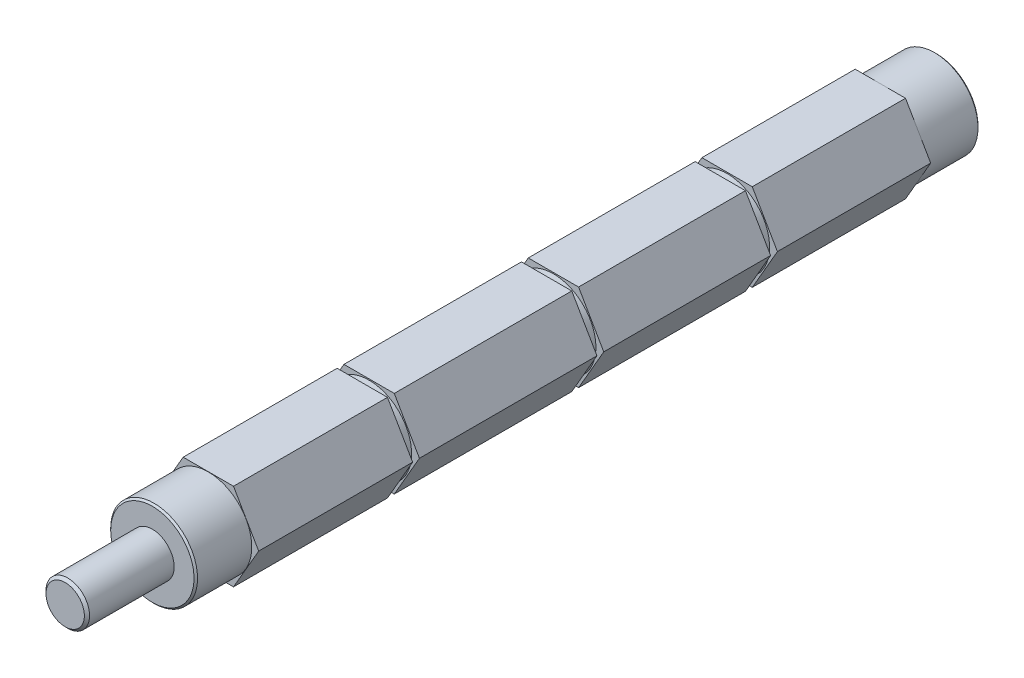
ISO-10303-21;
HEADER;
FILE_DESCRIPTION(('STEP AP214'),'2;1');
FILE_NAME('part.step','',(''),(''),'','','');
FILE_SCHEMA(('AUTOMOTIVE_DESIGN { 1 0 10303 214 1 1 1 1 }'));
ENDSEC;
DATA;
#1=APPLICATION_CONTEXT('core data for automotive mechanical design processes');
#2=APPLICATION_PROTOCOL_DEFINITION('international standard','automotive_design',2000,#1);
#3=PRODUCT_CONTEXT('',#1,'mechanical');
#4=PRODUCT('Part','Part','',(#3));
#5=PRODUCT_RELATED_PRODUCT_CATEGORY('part','',(#4));
#6=PRODUCT_DEFINITION_FORMATION('','',#4);
#7=PRODUCT_DEFINITION_CONTEXT('part definition',#1,'design');
#8=PRODUCT_DEFINITION('design','',#6,#7);
#9=PRODUCT_DEFINITION_SHAPE('','',#8);
#10=(LENGTH_UNIT() NAMED_UNIT(*) SI_UNIT(.MILLI.,.METRE.));
#11=(NAMED_UNIT(*) PLANE_ANGLE_UNIT() SI_UNIT($,.RADIAN.));
#12=(NAMED_UNIT(*) SI_UNIT($,.STERADIAN.) SOLID_ANGLE_UNIT());
#13=UNCERTAINTY_MEASURE_WITH_UNIT(LENGTH_MEASURE(1.E-05),#10,'distance_accuracy_value','');
#14=(GEOMETRIC_REPRESENTATION_CONTEXT(3) GLOBAL_UNCERTAINTY_ASSIGNED_CONTEXT((#13)) GLOBAL_UNIT_ASSIGNED_CONTEXT((#10,
#11,#12)) REPRESENTATION_CONTEXT('',''));
#15=CARTESIAN_POINT('',(0.,0.,0.));
#16=DIRECTION('',(0.,0.,1.));
#17=DIRECTION('',(1.,0.,0.));
#18=AXIS2_PLACEMENT_3D('',#15,#16,#17);
#19=CARTESIAN_POINT('',(0.,0.,-8.1534));
#20=DIRECTION('',(0.,0.,1.));
#21=DIRECTION('',(1.,0.,0.));
#22=AXIS2_PLACEMENT_3D('',#19,#20,#21);
#23=PLANE('',#22);
#24=CARTESIAN_POINT('',(0.,0.,-8.15340000013975));
#25=DIRECTION('',(0.,0.,1.));
#26=DIRECTION('',(1.,0.,0.));
#27=AXIS2_PLACEMENT_3D('',#24,#25,#26);
#28=CIRCLE('',#27,6.07060000010051);
#29=CARTESIAN_POINT('',(6.07060000010051,0.,-8.15340000013975));
#30=VERTEX_POINT('',#29);
#31=EDGE_CURVE('E20',#30,#30,#28,.T.);
#32=ORIENTED_EDGE('',*,*,#31,.F.);
#33=EDGE_LOOP('',(#32));
#34=FACE_BOUND('',#33,.T.);
#35=ADVANCED_FACE('F17',(#34),#23,.F.);
#36=CARTESIAN_POINT('',(0.,0.,-7.89939999998523));
#37=DIRECTION('',(0.,0.,1.));
#38=DIRECTION('',(1.,0.,0.));
#39=AXIS2_PLACEMENT_3D('',#36,#37,#38);
#40=CONICAL_SURFACE('',#39,6.32459999980028,0.785398162502276);
#41=CARTESIAN_POINT('',(0.,0.,-7.8994));
#42=DIRECTION('',(0.,0.,-1.));
#43=DIRECTION('',(-1.,0.,0.));
#44=AXIS2_PLACEMENT_3D('',#41,#42,#43);
#45=CIRCLE('',#44,6.3246);
#46=CARTESIAN_POINT('',(-6.3246,0.,-7.8994));
#47=VERTEX_POINT('',#46);
#48=EDGE_CURVE('E204',#47,#47,#45,.F.);
#49=ORIENTED_EDGE('',*,*,#48,.F.);
#50=EDGE_LOOP('',(#49));
#51=FACE_BOUND('',#50,.T.);
#52=ORIENTED_EDGE('',*,*,#31,.T.);
#53=EDGE_LOOP('',(#52));
#54=FACE_BOUND('',#53,.T.);
#55=ADVANCED_FACE('F258',(#51,#54),#40,.T.);
#56=CARTESIAN_POINT('',(0.,0.,0.));
#57=DIRECTION('',(0.,0.,-1.));
#58=DIRECTION('',(-1.,0.,0.));
#59=AXIS2_PLACEMENT_3D('',#56,#57,#58);
#60=CYLINDRICAL_SURFACE('',#59,6.3246);
#61=ORIENTED_EDGE('',*,*,#48,.T.);
#62=EDGE_LOOP('',(#61));
#63=FACE_BOUND('',#62,.T.);
#64=CARTESIAN_POINT('',(0.,0.,0.));
#65=DIRECTION('',(0.,0.,-1.));
#66=DIRECTION('',(-1.,0.,0.));
#67=AXIS2_PLACEMENT_3D('',#64,#65,#66);
#68=CIRCLE('',#67,6.3246);
#69=CARTESIAN_POINT('',(-6.3246,0.,0.));
#70=VERTEX_POINT('',#69);
#71=EDGE_CURVE('E186',#70,#70,#68,.T.);
#72=ORIENTED_EDGE('',*,*,#71,.T.);
#73=EDGE_LOOP('',(#72));
#74=FACE_BOUND('',#73,.T.);
#75=ADVANCED_FACE('F248',(#63,#74),#60,.T.);
#76=CARTESIAN_POINT('',(0.,0.,0.));
#77=DIRECTION('',(0.,0.,1.));
#78=DIRECTION('',(1.,0.,0.));
#79=AXIS2_PLACEMENT_3D('',#76,#77,#78);
#80=PLANE('',#79);
#81=ORIENTED_EDGE('',*,*,#71,.F.);
#82=EDGE_LOOP('',(#81));
#83=FACE_BOUND('',#82,.T.);
#84=DIRECTION('',(0.5,0.866025403784439,0.));
#85=VECTOR('',#84,1.);
#86=CARTESIAN_POINT('',(7.33234841870825,0.,0.));
#87=LINE('',#86,#85);
#88=CARTESIAN_POINT('',(3.66617420935414,-6.35,0.));
#89=VERTEX_POINT('',#88);
#90=CARTESIAN_POINT('',(7.33234841870825,0.,0.));
#91=VERTEX_POINT('',#90);
#92=EDGE_CURVE('E183',#89,#91,#87,.T.);
#93=ORIENTED_EDGE('',*,*,#92,.F.);
#94=DIRECTION('',(1.,0.,0.));
#95=VECTOR('',#94,1.);
#96=CARTESIAN_POINT('',(3.66617420935414,-6.35,0.));
#97=LINE('',#96,#95);
#98=CARTESIAN_POINT('',(-3.66617420935411,-6.35,0.));
#99=VERTEX_POINT('',#98);
#100=EDGE_CURVE('E179',#99,#89,#97,.T.);
#101=ORIENTED_EDGE('',*,*,#100,.F.);
#102=DIRECTION('',(0.5,-0.866025403784438,0.));
#103=VECTOR('',#102,1.);
#104=CARTESIAN_POINT('',(-3.66617420935411,-6.35,0.));
#105=LINE('',#104,#103);
#106=CARTESIAN_POINT('',(-7.33234841870825,0.,0.));
#107=VERTEX_POINT('',#106);
#108=EDGE_CURVE('E176',#107,#99,#105,.T.);
#109=ORIENTED_EDGE('',*,*,#108,.F.);
#110=DIRECTION('',(-0.5,-0.866025403784439,0.));
#111=VECTOR('',#110,1.);
#112=CARTESIAN_POINT('',(-7.33234841870825,0.,0.));
#113=LINE('',#112,#111);
#114=CARTESIAN_POINT('',(-3.66617420935414,6.35,0.));
#115=VERTEX_POINT('',#114);
#116=EDGE_CURVE('E195',#115,#107,#113,.T.);
#117=ORIENTED_EDGE('',*,*,#116,.F.);
#118=DIRECTION('',(1.,0.,0.));
#119=VECTOR('',#118,1.);
#120=CARTESIAN_POINT('',(-3.66617420935414,6.35,0.));
#121=LINE('',#120,#119);
#122=CARTESIAN_POINT('',(3.66617420935411,6.35,0.));
#123=VERTEX_POINT('',#122);
#124=EDGE_CURVE('E697',#123,#115,#121,.F.);
#125=ORIENTED_EDGE('',*,*,#124,.F.);
#126=DIRECTION('',(-0.5,0.866025403784439,0.));
#127=VECTOR('',#126,1.);
#128=CARTESIAN_POINT('',(3.66617420935411,6.35,0.));
#129=LINE('',#128,#127);
#130=EDGE_CURVE('E702',#91,#123,#129,.T.);
#131=ORIENTED_EDGE('',*,*,#130,.F.);
#132=EDGE_LOOP('',(#93,#101,#109,#117,#125,#131));
#133=FACE_BOUND('',#132,.T.);
#134=ADVANCED_FACE('F181',(#83,#133),#80,.F.);
#135=CARTESIAN_POINT('',(3.66617420935414,-6.35,0.));
#136=DIRECTION('',(0.,-1.,0.));
#137=DIRECTION('',(0.,0.,-1.));
#138=AXIS2_PLACEMENT_3D('',#135,#136,#137);
#139=PLANE('',#138);
#140=ORIENTED_EDGE('',*,*,#100,.T.);
#141=DIRECTION('',(0.,0.,1.));
#142=VECTOR('',#141,1.);
#143=CARTESIAN_POINT('',(3.66617420935413,-6.35,0.));
#144=LINE('',#143,#142);
#145=CARTESIAN_POINT('',(3.66617420935414,-6.35,22.3266));
#146=VERTEX_POINT('',#145);
#147=EDGE_CURVE('E708',#146,#89,#144,.F.);
#148=ORIENTED_EDGE('',*,*,#147,.F.);
#149=DIRECTION('',(-1.,0.,0.));
#150=VECTOR('',#149,1.);
#151=CARTESIAN_POINT('',(-6.76084841870825,-6.35,22.3266));
#152=LINE('',#151,#150);
#153=CARTESIAN_POINT('',(-3.66617420935411,-6.35,22.3266));
#154=VERTEX_POINT('',#153);
#155=EDGE_CURVE('E192',#146,#154,#152,.T.);
#156=ORIENTED_EDGE('',*,*,#155,.T.);
#157=DIRECTION('',(0.,0.,1.));
#158=VECTOR('',#157,1.);
#159=CARTESIAN_POINT('',(-3.66617420935411,-6.35,0.));
#160=LINE('',#159,#158);
#161=EDGE_CURVE('E189',#99,#154,#160,.T.);
#162=ORIENTED_EDGE('',*,*,#161,.F.);
#163=EDGE_LOOP('',(#140,#148,#156,#162));
#164=FACE_BOUND('',#163,.T.);
#165=ADVANCED_FACE('F190',(#164),#139,.T.);
#166=CARTESIAN_POINT('',(-3.66617420935411,-6.35,0.));
#167=DIRECTION('',(-0.866025403784438,-0.5,0.));
#168=DIRECTION('',(0.5,-0.866025403784438,0.));
#169=AXIS2_PLACEMENT_3D('',#166,#167,#168);
#170=PLANE('',#169);
#171=ORIENTED_EDGE('',*,*,#108,.T.);
#172=ORIENTED_EDGE('',*,*,#161,.T.);
#173=DIRECTION('',(-0.500000000000001,0.866025403784438,0.));
#174=VECTOR('',#173,1.);
#175=CARTESIAN_POINT('',(-3.66617420935411,-6.35,22.3266));
#176=LINE('',#175,#174);
#177=CARTESIAN_POINT('',(-7.33234841870825,0.,22.3266));
#178=VERTEX_POINT('',#177);
#179=EDGE_CURVE('E715',#154,#178,#176,.T.);
#180=ORIENTED_EDGE('',*,*,#179,.T.);
#181=DIRECTION('',(0.,0.,1.));
#182=VECTOR('',#181,1.);
#183=CARTESIAN_POINT('',(-7.33234841870825,0.,0.));
#184=LINE('',#183,#182);
#185=EDGE_CURVE('E199',#107,#178,#184,.T.);
#186=ORIENTED_EDGE('',*,*,#185,.F.);
#187=EDGE_LOOP('',(#171,#172,#180,#186));
#188=FACE_BOUND('',#187,.T.);
#189=ADVANCED_FACE('F197',(#188),#170,.T.);
#190=CARTESIAN_POINT('',(-7.33234841870825,0.,0.));
#191=DIRECTION('',(-0.866025403784439,0.5,0.));
#192=DIRECTION('',(-0.5,-0.866025403784439,0.));
#193=AXIS2_PLACEMENT_3D('',#190,#191,#192);
#194=PLANE('',#193);
#195=ORIENTED_EDGE('',*,*,#116,.T.);
#196=ORIENTED_EDGE('',*,*,#185,.T.);
#197=DIRECTION('',(0.499999999999999,0.866025403784439,0.));
#198=VECTOR('',#197,1.);
#199=CARTESIAN_POINT('',(-7.33234841870825,0.,22.3266));
#200=LINE('',#199,#198);
#201=CARTESIAN_POINT('',(-3.66617420935413,6.35,22.3266));
#202=VERTEX_POINT('',#201);
#203=EDGE_CURVE('E717',#178,#202,#200,.T.);
#204=ORIENTED_EDGE('',*,*,#203,.T.);
#205=DIRECTION('',(0.,0.,1.));
#206=VECTOR('',#205,1.);
#207=CARTESIAN_POINT('',(-3.66617420935414,6.35,0.));
#208=LINE('',#207,#206);
#209=EDGE_CURVE('E695',#115,#202,#208,.T.);
#210=ORIENTED_EDGE('',*,*,#209,.F.);
#211=EDGE_LOOP('',(#195,#196,#204,#210));
#212=FACE_BOUND('',#211,.T.);
#213=ADVANCED_FACE('F411',(#212),#194,.T.);
#214=CARTESIAN_POINT('',(-3.66617420935414,6.35,0.));
#215=DIRECTION('',(0.,1.,0.));
#216=DIRECTION('',(0.,0.,1.));
#217=AXIS2_PLACEMENT_3D('',#214,#215,#216);
#218=PLANE('',#217);
#219=ORIENTED_EDGE('',*,*,#124,.T.);
#220=ORIENTED_EDGE('',*,*,#209,.T.);
#221=DIRECTION('',(-1.,0.,0.));
#222=VECTOR('',#221,1.);
#223=CARTESIAN_POINT('',(-6.76084841870825,6.35,22.3266));
#224=LINE('',#223,#222);
#225=CARTESIAN_POINT('',(3.66617420935411,6.35,22.3266));
#226=VERTEX_POINT('',#225);
#227=EDGE_CURVE('E719',#202,#226,#224,.F.);
#228=ORIENTED_EDGE('',*,*,#227,.T.);
#229=DIRECTION('',(0.,0.,1.));
#230=VECTOR('',#229,1.);
#231=CARTESIAN_POINT('',(3.66617420935411,6.35,0.));
#232=LINE('',#231,#230);
#233=EDGE_CURVE('E705',#123,#226,#232,.T.);
#234=ORIENTED_EDGE('',*,*,#233,.F.);
#235=EDGE_LOOP('',(#219,#220,#228,#234));
#236=FACE_BOUND('',#235,.T.);
#237=ADVANCED_FACE('F407',(#236),#218,.T.);
#238=CARTESIAN_POINT('',(3.66617420935411,6.35,0.));
#239=DIRECTION('',(0.866025403784439,0.5,0.));
#240=DIRECTION('',(-0.5,0.866025403784439,0.));
#241=AXIS2_PLACEMENT_3D('',#238,#239,#240);
#242=PLANE('',#241);
#243=ORIENTED_EDGE('',*,*,#130,.T.);
#244=ORIENTED_EDGE('',*,*,#233,.T.);
#245=DIRECTION('',(0.500000000000001,-0.866025403784438,0.));
#246=VECTOR('',#245,1.);
#247=CARTESIAN_POINT('',(3.66617420935411,6.35,22.3266));
#248=LINE('',#247,#246);
#249=CARTESIAN_POINT('',(7.33234841870825,0.,22.3266));
#250=VERTEX_POINT('',#249);
#251=EDGE_CURVE('E721',#226,#250,#248,.T.);
#252=ORIENTED_EDGE('',*,*,#251,.T.);
#253=DIRECTION('',(0.,0.,1.));
#254=VECTOR('',#253,1.);
#255=CARTESIAN_POINT('',(7.33234841870825,0.,0.));
#256=LINE('',#255,#254);
#257=EDGE_CURVE('E711',#91,#250,#256,.T.);
#258=ORIENTED_EDGE('',*,*,#257,.F.);
#259=EDGE_LOOP('',(#243,#244,#252,#258));
#260=FACE_BOUND('',#259,.T.);
#261=ADVANCED_FACE('F403',(#260),#242,.T.);
#262=CARTESIAN_POINT('',(7.33234841870825,0.,0.));
#263=DIRECTION('',(0.866025403784439,-0.5,0.));
#264=DIRECTION('',(0.5,0.866025403784439,0.));
#265=AXIS2_PLACEMENT_3D('',#262,#263,#264);
#266=PLANE('',#265);
#267=ORIENTED_EDGE('',*,*,#92,.T.);
#268=ORIENTED_EDGE('',*,*,#257,.T.);
#269=DIRECTION('',(-0.499999999999999,-0.866025403784439,0.));
#270=VECTOR('',#269,1.);
#271=CARTESIAN_POINT('',(7.33234841870825,0.,22.3266));
#272=LINE('',#271,#270);
#273=EDGE_CURVE('E244',#250,#146,#272,.T.);
#274=ORIENTED_EDGE('',*,*,#273,.T.);
#275=ORIENTED_EDGE('',*,*,#147,.T.);
#276=EDGE_LOOP('',(#267,#268,#274,#275));
#277=FACE_BOUND('',#276,.T.);
#278=ADVANCED_FACE('F399',(#277),#266,.T.);
#279=CARTESIAN_POINT('',(-6.76084841870825,0.,22.3266));
#280=DIRECTION('',(0.,0.,-1.));
#281=DIRECTION('',(-1.,0.,0.));
#282=AXIS2_PLACEMENT_3D('',#279,#280,#281);
#283=PLANE('',#282);
#284=CARTESIAN_POINT('',(0.,0.,22.3266));
#285=DIRECTION('',(0.,0.,-1.));
#286=DIRECTION('',(-1.,0.,0.));
#287=AXIS2_PLACEMENT_3D('',#284,#285,#286);
#288=CIRCLE('',#287,6.18934841870825);
#289=CARTESIAN_POINT('',(-6.18934841870825,0.,22.3266));
#290=VERTEX_POINT('',#289);
#291=EDGE_CURVE('E242',#290,#290,#288,.F.);
#292=ORIENTED_EDGE('',*,*,#291,.F.);
#293=EDGE_LOOP('',(#292));
#294=FACE_BOUND('',#293,.T.);
#295=ORIENTED_EDGE('',*,*,#251,.F.);
#296=ORIENTED_EDGE('',*,*,#227,.F.);
#297=ORIENTED_EDGE('',*,*,#203,.F.);
#298=ORIENTED_EDGE('',*,*,#179,.F.);
#299=ORIENTED_EDGE('',*,*,#155,.F.);
#300=ORIENTED_EDGE('',*,*,#273,.F.);
#301=EDGE_LOOP('',(#295,#296,#297,#298,#299,#300));
#302=FACE_BOUND('',#301,.T.);
#303=ADVANCED_FACE('F395',(#294,#302),#283,.F.);
#304=CARTESIAN_POINT('',(0.,0.,22.8219));
#305=DIRECTION('',(0.,0.,-1.));
#306=DIRECTION('',(-1.,0.,0.));
#307=AXIS2_PLACEMENT_3D('',#304,#305,#306);
#308=CYLINDRICAL_SURFACE('',#307,6.18934841870825);
#309=ORIENTED_EDGE('',*,*,#291,.T.);
#310=EDGE_LOOP('',(#309));
#311=FACE_BOUND('',#310,.T.);
#312=CARTESIAN_POINT('',(0.,0.,23.3172));
#313=DIRECTION('',(0.,0.,-1.));
#314=DIRECTION('',(-1.,0.,0.));
#315=AXIS2_PLACEMENT_3D('',#312,#313,#314);
#316=CIRCLE('',#315,6.18934841870825);
#317=CARTESIAN_POINT('',(-6.18934841870825,0.,23.3172));
#318=VERTEX_POINT('',#317);
#319=EDGE_CURVE('E238',#318,#318,#316,.T.);
#320=ORIENTED_EDGE('',*,*,#319,.T.);
#321=EDGE_LOOP('',(#320));
#322=FACE_BOUND('',#321,.T.);
#323=ADVANCED_FACE('F391',(#311,#322),#308,.T.);
#324=CARTESIAN_POINT('',(-6.76084841870825,0.,23.3172));
#325=DIRECTION('',(0.,0.,1.));
#326=DIRECTION('',(1.,0.,0.));
#327=AXIS2_PLACEMENT_3D('',#324,#325,#326);
#328=PLANE('',#327);
#329=ORIENTED_EDGE('',*,*,#319,.F.);
#330=EDGE_LOOP('',(#329));
#331=FACE_BOUND('',#330,.T.);
#332=DIRECTION('',(1.,0.,0.));
#333=VECTOR('',#332,1.);
#334=CARTESIAN_POINT('',(3.66617420935414,-6.35,23.3172));
#335=LINE('',#334,#333);
#336=CARTESIAN_POINT('',(-3.66617420935411,-6.35,23.3172));
#337=VERTEX_POINT('',#336);
#338=CARTESIAN_POINT('',(3.66617420935414,-6.35,23.3172));
#339=VERTEX_POINT('',#338);
#340=EDGE_CURVE('E241',#337,#339,#335,.T.);
#341=ORIENTED_EDGE('',*,*,#340,.F.);
#342=DIRECTION('',(0.5,-0.866025403784438,0.));
#343=VECTOR('',#342,1.);
#344=CARTESIAN_POINT('',(-3.66617420935411,-6.35,23.3172));
#345=LINE('',#344,#343);
#346=CARTESIAN_POINT('',(-7.33234841870825,0.,23.3172));
#347=VERTEX_POINT('',#346);
#348=EDGE_CURVE('E727',#347,#337,#345,.T.);
#349=ORIENTED_EDGE('',*,*,#348,.F.);
#350=DIRECTION('',(-0.5,-0.866025403784439,0.));
#351=VECTOR('',#350,1.);
#352=CARTESIAN_POINT('',(-7.33234841870825,0.,23.3172));
#353=LINE('',#352,#351);
#354=CARTESIAN_POINT('',(-3.66617420935414,6.35,23.3172));
#355=VERTEX_POINT('',#354);
#356=EDGE_CURVE('E733',#355,#347,#353,.T.);
#357=ORIENTED_EDGE('',*,*,#356,.F.);
#358=DIRECTION('',(1.,0.,0.));
#359=VECTOR('',#358,1.);
#360=CARTESIAN_POINT('',(-3.66617420935414,6.35,23.3172));
#361=LINE('',#360,#359);
#362=CARTESIAN_POINT('',(3.66617420935411,6.35,23.3172));
#363=VERTEX_POINT('',#362);
#364=EDGE_CURVE('E739',#363,#355,#361,.F.);
#365=ORIENTED_EDGE('',*,*,#364,.F.);
#366=DIRECTION('',(-0.5,0.866025403784439,0.));
#367=VECTOR('',#366,1.);
#368=CARTESIAN_POINT('',(3.66617420935411,6.35,23.3172));
#369=LINE('',#368,#367);
#370=CARTESIAN_POINT('',(7.33234841870825,0.,23.3172));
#371=VERTEX_POINT('',#370);
#372=EDGE_CURVE('E745',#371,#363,#369,.T.);
#373=ORIENTED_EDGE('',*,*,#372,.F.);
#374=DIRECTION('',(0.5,0.866025403784439,0.));
#375=VECTOR('',#374,1.);
#376=CARTESIAN_POINT('',(7.33234841870825,0.,23.3172));
#377=LINE('',#376,#375);
#378=EDGE_CURVE('E751',#339,#371,#377,.T.);
#379=ORIENTED_EDGE('',*,*,#378,.F.);
#380=EDGE_LOOP('',(#341,#349,#357,#365,#373,#379));
#381=FACE_BOUND('',#380,.T.);
#382=ADVANCED_FACE('F387',(#331,#381),#328,.F.);
#383=CARTESIAN_POINT('',(3.66617420935414,-6.35,0.));
#384=DIRECTION('',(0.,-1.,0.));
#385=DIRECTION('',(0.,0.,-1.));
#386=AXIS2_PLACEMENT_3D('',#383,#384,#385);
#387=PLANE('',#386);
#388=DIRECTION('',(-1.,0.,0.));
#389=VECTOR('',#388,1.);
#390=CARTESIAN_POINT('',(-6.76084841870825,-6.35,47.625));
#391=LINE('',#390,#389);
#392=CARTESIAN_POINT('',(3.66617420935414,-6.35,47.625));
#393=VERTEX_POINT('',#392);
#394=CARTESIAN_POINT('',(-3.66617420935411,-6.35,47.625));
#395=VERTEX_POINT('',#394);
#396=EDGE_CURVE('E760',#393,#395,#391,.T.);
#397=ORIENTED_EDGE('',*,*,#396,.T.);
#398=DIRECTION('',(0.,0.,1.));
#399=VECTOR('',#398,1.);
#400=CARTESIAN_POINT('',(-3.66617420935411,-6.35,0.));
#401=LINE('',#400,#399);
#402=EDGE_CURVE('E730',#337,#395,#401,.T.);
#403=ORIENTED_EDGE('',*,*,#402,.F.);
#404=ORIENTED_EDGE('',*,*,#340,.T.);
#405=DIRECTION('',(0.,0.,1.));
#406=VECTOR('',#405,1.);
#407=CARTESIAN_POINT('',(3.66617420935413,-6.35,0.));
#408=LINE('',#407,#406);
#409=EDGE_CURVE('E757',#393,#339,#408,.F.);
#410=ORIENTED_EDGE('',*,*,#409,.F.);
#411=EDGE_LOOP('',(#397,#403,#404,#410));
#412=FACE_BOUND('',#411,.T.);
#413=ADVANCED_FACE('F383',(#412),#387,.T.);
#414=CARTESIAN_POINT('',(-3.66617420935411,-6.35,0.));
#415=DIRECTION('',(-0.866025403784438,-0.5,0.));
#416=DIRECTION('',(0.5,-0.866025403784438,0.));
#417=AXIS2_PLACEMENT_3D('',#414,#415,#416);
#418=PLANE('',#417);
#419=DIRECTION('',(-0.500000000000001,0.866025403784438,0.));
#420=VECTOR('',#419,1.);
#421=CARTESIAN_POINT('',(-3.66617420935411,-6.35,47.625));
#422=LINE('',#421,#420);
#423=CARTESIAN_POINT('',(-7.33234841870825,0.,47.625));
#424=VERTEX_POINT('',#423);
#425=EDGE_CURVE('E762',#395,#424,#422,.T.);
#426=ORIENTED_EDGE('',*,*,#425,.T.);
#427=DIRECTION('',(0.,0.,1.));
#428=VECTOR('',#427,1.);
#429=CARTESIAN_POINT('',(-7.33234841870825,0.,0.));
#430=LINE('',#429,#428);
#431=EDGE_CURVE('E736',#347,#424,#430,.T.);
#432=ORIENTED_EDGE('',*,*,#431,.F.);
#433=ORIENTED_EDGE('',*,*,#348,.T.);
#434=ORIENTED_EDGE('',*,*,#402,.T.);
#435=EDGE_LOOP('',(#426,#432,#433,#434));
#436=FACE_BOUND('',#435,.T.);
#437=ADVANCED_FACE('F379',(#436),#418,.T.);
#438=CARTESIAN_POINT('',(-7.33234841870825,0.,0.));
#439=DIRECTION('',(-0.866025403784439,0.5,0.));
#440=DIRECTION('',(-0.5,-0.866025403784439,0.));
#441=AXIS2_PLACEMENT_3D('',#438,#439,#440);
#442=PLANE('',#441);
#443=DIRECTION('',(0.499999999999999,0.866025403784439,0.));
#444=VECTOR('',#443,1.);
#445=CARTESIAN_POINT('',(-7.33234841870825,0.,47.625));
#446=LINE('',#445,#444);
#447=CARTESIAN_POINT('',(-3.66617420935413,6.35,47.625));
#448=VERTEX_POINT('',#447);
#449=EDGE_CURVE('E764',#424,#448,#446,.T.);
#450=ORIENTED_EDGE('',*,*,#449,.T.);
#451=DIRECTION('',(0.,0.,1.));
#452=VECTOR('',#451,1.);
#453=CARTESIAN_POINT('',(-3.66617420935414,6.35,0.));
#454=LINE('',#453,#452);
#455=EDGE_CURVE('E742',#355,#448,#454,.T.);
#456=ORIENTED_EDGE('',*,*,#455,.F.);
#457=ORIENTED_EDGE('',*,*,#356,.T.);
#458=ORIENTED_EDGE('',*,*,#431,.T.);
#459=EDGE_LOOP('',(#450,#456,#457,#458));
#460=FACE_BOUND('',#459,.T.);
#461=ADVANCED_FACE('F375',(#460),#442,.T.);
#462=CARTESIAN_POINT('',(-3.66617420935414,6.35,0.));
#463=DIRECTION('',(0.,1.,0.));
#464=DIRECTION('',(0.,0.,1.));
#465=AXIS2_PLACEMENT_3D('',#462,#463,#464);
#466=PLANE('',#465);
#467=DIRECTION('',(-1.,0.,0.));
#468=VECTOR('',#467,1.);
#469=CARTESIAN_POINT('',(-6.76084841870825,6.35,47.625));
#470=LINE('',#469,#468);
#471=CARTESIAN_POINT('',(3.66617420935411,6.35,47.625));
#472=VERTEX_POINT('',#471);
#473=EDGE_CURVE('E766',#448,#472,#470,.F.);
#474=ORIENTED_EDGE('',*,*,#473,.T.);
#475=DIRECTION('',(0.,0.,1.));
#476=VECTOR('',#475,1.);
#477=CARTESIAN_POINT('',(3.66617420935411,6.35,0.));
#478=LINE('',#477,#476);
#479=EDGE_CURVE('E748',#363,#472,#478,.T.);
#480=ORIENTED_EDGE('',*,*,#479,.F.);
#481=ORIENTED_EDGE('',*,*,#364,.T.);
#482=ORIENTED_EDGE('',*,*,#455,.T.);
#483=EDGE_LOOP('',(#474,#480,#481,#482));
#484=FACE_BOUND('',#483,.T.);
#485=ADVANCED_FACE('F371',(#484),#466,.T.);
#486=CARTESIAN_POINT('',(3.66617420935411,6.35,0.));
#487=DIRECTION('',(0.866025403784439,0.5,0.));
#488=DIRECTION('',(-0.5,0.866025403784439,0.));
#489=AXIS2_PLACEMENT_3D('',#486,#487,#488);
#490=PLANE('',#489);
#491=DIRECTION('',(0.500000000000001,-0.866025403784438,0.));
#492=VECTOR('',#491,1.);
#493=CARTESIAN_POINT('',(3.66617420935411,6.35,47.625));
#494=LINE('',#493,#492);
#495=CARTESIAN_POINT('',(7.33234841870824,0.,47.625));
#496=VERTEX_POINT('',#495);
#497=EDGE_CURVE('E768',#472,#496,#494,.T.);
#498=ORIENTED_EDGE('',*,*,#497,.T.);
#499=DIRECTION('',(0.,0.,1.));
#500=VECTOR('',#499,1.);
#501=CARTESIAN_POINT('',(7.33234841870825,0.,0.));
#502=LINE('',#501,#500);
#503=EDGE_CURVE('E754',#371,#496,#502,.T.);
#504=ORIENTED_EDGE('',*,*,#503,.F.);
#505=ORIENTED_EDGE('',*,*,#372,.T.);
#506=ORIENTED_EDGE('',*,*,#479,.T.);
#507=EDGE_LOOP('',(#498,#504,#505,#506));
#508=FACE_BOUND('',#507,.T.);
#509=ADVANCED_FACE('F367',(#508),#490,.T.);
#510=CARTESIAN_POINT('',(7.33234841870825,0.,0.));
#511=DIRECTION('',(0.866025403784439,-0.5,0.));
#512=DIRECTION('',(0.5,0.866025403784439,0.));
#513=AXIS2_PLACEMENT_3D('',#510,#511,#512);
#514=PLANE('',#513);
#515=DIRECTION('',(-0.499999999999999,-0.866025403784439,0.));
#516=VECTOR('',#515,1.);
#517=CARTESIAN_POINT('',(7.33234841870825,0.,47.625));
#518=LINE('',#517,#516);
#519=EDGE_CURVE('E237',#496,#393,#518,.T.);
#520=ORIENTED_EDGE('',*,*,#519,.T.);
#521=ORIENTED_EDGE('',*,*,#409,.T.);
#522=ORIENTED_EDGE('',*,*,#378,.T.);
#523=ORIENTED_EDGE('',*,*,#503,.T.);
#524=EDGE_LOOP('',(#520,#521,#522,#523));
#525=FACE_BOUND('',#524,.T.);
#526=ADVANCED_FACE('F363',(#525),#514,.T.);
#527=CARTESIAN_POINT('',(-6.76084841870825,0.,47.625));
#528=DIRECTION('',(0.,0.,-1.));
#529=DIRECTION('',(-1.,0.,0.));
#530=AXIS2_PLACEMENT_3D('',#527,#528,#529);
#531=PLANE('',#530);
#532=CARTESIAN_POINT('',(0.,0.,47.625));
#533=DIRECTION('',(0.,0.,-1.));
#534=DIRECTION('',(-1.,0.,0.));
#535=AXIS2_PLACEMENT_3D('',#532,#533,#534);
#536=CIRCLE('',#535,6.18934841870825);
#537=CARTESIAN_POINT('',(-6.18934841870825,0.,47.625));
#538=VERTEX_POINT('',#537);
#539=EDGE_CURVE('E234',#538,#538,#536,.F.);
#540=ORIENTED_EDGE('',*,*,#539,.F.);
#541=EDGE_LOOP('',(#540));
#542=FACE_BOUND('',#541,.T.);
#543=ORIENTED_EDGE('',*,*,#497,.F.);
#544=ORIENTED_EDGE('',*,*,#473,.F.);
#545=ORIENTED_EDGE('',*,*,#449,.F.);
#546=ORIENTED_EDGE('',*,*,#425,.F.);
#547=ORIENTED_EDGE('',*,*,#396,.F.);
#548=ORIENTED_EDGE('',*,*,#519,.F.);
#549=EDGE_LOOP('',(#543,#544,#545,#546,#547,#548));
#550=FACE_BOUND('',#549,.T.);
#551=ADVANCED_FACE('F359',(#542,#550),#531,.F.);
#552=CARTESIAN_POINT('',(0.,0.,48.1203));
#553=DIRECTION('',(0.,0.,-1.));
#554=DIRECTION('',(-1.,0.,0.));
#555=AXIS2_PLACEMENT_3D('',#552,#553,#554);
#556=CYLINDRICAL_SURFACE('',#555,6.18934841870825);
#557=ORIENTED_EDGE('',*,*,#539,.T.);
#558=EDGE_LOOP('',(#557));
#559=FACE_BOUND('',#558,.T.);
#560=CARTESIAN_POINT('',(0.,0.,48.6156));
#561=DIRECTION('',(0.,0.,-1.));
#562=DIRECTION('',(-1.,0.,0.));
#563=AXIS2_PLACEMENT_3D('',#560,#561,#562);
#564=CIRCLE('',#563,6.18934841870825);
#565=CARTESIAN_POINT('',(-6.18934841870825,0.,48.6156));
#566=VERTEX_POINT('',#565);
#567=EDGE_CURVE('E230',#566,#566,#564,.T.);
#568=ORIENTED_EDGE('',*,*,#567,.T.);
#569=EDGE_LOOP('',(#568));
#570=FACE_BOUND('',#569,.T.);
#571=ADVANCED_FACE('F355',(#559,#570),#556,.T.);
#572=CARTESIAN_POINT('',(-6.76084841870825,0.,48.6156));
#573=DIRECTION('',(0.,0.,1.));
#574=DIRECTION('',(1.,0.,0.));
#575=AXIS2_PLACEMENT_3D('',#572,#573,#574);
#576=PLANE('',#575);
#577=ORIENTED_EDGE('',*,*,#567,.F.);
#578=EDGE_LOOP('',(#577));
#579=FACE_BOUND('',#578,.T.);
#580=DIRECTION('',(1.,0.,0.));
#581=VECTOR('',#580,1.);
#582=CARTESIAN_POINT('',(3.66617420935414,-6.35,48.6156));
#583=LINE('',#582,#581);
#584=CARTESIAN_POINT('',(-3.66617420935411,-6.35,48.6156));
#585=VERTEX_POINT('',#584);
#586=CARTESIAN_POINT('',(3.66617420935414,-6.35,48.6156));
#587=VERTEX_POINT('',#586);
#588=EDGE_CURVE('E233',#585,#587,#583,.T.);
#589=ORIENTED_EDGE('',*,*,#588,.F.);
#590=DIRECTION('',(0.5,-0.866025403784438,0.));
#591=VECTOR('',#590,1.);
#592=CARTESIAN_POINT('',(-3.66617420935411,-6.35,48.6156));
#593=LINE('',#592,#591);
#594=CARTESIAN_POINT('',(-7.33234841870825,0.,48.6156));
#595=VERTEX_POINT('',#594);
#596=EDGE_CURVE('E774',#595,#585,#593,.T.);
#597=ORIENTED_EDGE('',*,*,#596,.F.);
#598=DIRECTION('',(-0.5,-0.866025403784439,0.));
#599=VECTOR('',#598,1.);
#600=CARTESIAN_POINT('',(-7.33234841870825,0.,48.6156));
#601=LINE('',#600,#599);
#602=CARTESIAN_POINT('',(-3.66617420935414,6.35,48.6156));
#603=VERTEX_POINT('',#602);
#604=EDGE_CURVE('E780',#603,#595,#601,.T.);
#605=ORIENTED_EDGE('',*,*,#604,.F.);
#606=DIRECTION('',(1.,0.,0.));
#607=VECTOR('',#606,1.);
#608=CARTESIAN_POINT('',(-3.66617420935414,6.35,48.6156));
#609=LINE('',#608,#607);
#610=CARTESIAN_POINT('',(3.66617420935411,6.35,48.6156));
#611=VERTEX_POINT('',#610);
#612=EDGE_CURVE('E786',#611,#603,#609,.F.);
#613=ORIENTED_EDGE('',*,*,#612,.F.);
#614=DIRECTION('',(-0.5,0.866025403784439,0.));
#615=VECTOR('',#614,1.);
#616=CARTESIAN_POINT('',(3.66617420935411,6.35,48.6156));
#617=LINE('',#616,#615);
#618=CARTESIAN_POINT('',(7.33234841870825,0.,48.6156));
#619=VERTEX_POINT('',#618);
#620=EDGE_CURVE('E792',#619,#611,#617,.T.);
#621=ORIENTED_EDGE('',*,*,#620,.F.);
#622=DIRECTION('',(0.5,0.866025403784439,0.));
#623=VECTOR('',#622,1.);
#624=CARTESIAN_POINT('',(7.33234841870825,0.,48.6156));
#625=LINE('',#624,#623);
#626=EDGE_CURVE('E798',#587,#619,#625,.T.);
#627=ORIENTED_EDGE('',*,*,#626,.F.);
#628=EDGE_LOOP('',(#589,#597,#605,#613,#621,#627));
#629=FACE_BOUND('',#628,.T.);
#630=ADVANCED_FACE('F351',(#579,#629),#576,.F.);
#631=CARTESIAN_POINT('',(3.66617420935414,-6.35,0.));
#632=DIRECTION('',(0.,-1.,0.));
#633=DIRECTION('',(0.,0.,-1.));
#634=AXIS2_PLACEMENT_3D('',#631,#632,#633);
#635=PLANE('',#634);
#636=DIRECTION('',(-1.,0.,0.));
#637=VECTOR('',#636,1.);
#638=CARTESIAN_POINT('',(-6.76084841870825,-6.35,74.4728));
#639=LINE('',#638,#637);
#640=CARTESIAN_POINT('',(3.66617420935414,-6.35,74.4728));
#641=VERTEX_POINT('',#640);
#642=CARTESIAN_POINT('',(-3.66617420935411,-6.35,74.4728));
#643=VERTEX_POINT('',#642);
#644=EDGE_CURVE('E807',#641,#643,#639,.T.);
#645=ORIENTED_EDGE('',*,*,#644,.T.);
#646=DIRECTION('',(0.,0.,1.));
#647=VECTOR('',#646,1.);
#648=CARTESIAN_POINT('',(-3.66617420935411,-6.35,0.));
#649=LINE('',#648,#647);
#650=EDGE_CURVE('E777',#585,#643,#649,.T.);
#651=ORIENTED_EDGE('',*,*,#650,.F.);
#652=ORIENTED_EDGE('',*,*,#588,.T.);
#653=DIRECTION('',(0.,0.,1.));
#654=VECTOR('',#653,1.);
#655=CARTESIAN_POINT('',(3.66617420935413,-6.35,0.));
#656=LINE('',#655,#654);
#657=EDGE_CURVE('E804',#641,#587,#656,.F.);
#658=ORIENTED_EDGE('',*,*,#657,.F.);
#659=EDGE_LOOP('',(#645,#651,#652,#658));
#660=FACE_BOUND('',#659,.T.);
#661=ADVANCED_FACE('F347',(#660),#635,.T.);
#662=CARTESIAN_POINT('',(-3.66617420935411,-6.35,0.));
#663=DIRECTION('',(-0.866025403784438,-0.5,0.));
#664=DIRECTION('',(0.5,-0.866025403784438,0.));
#665=AXIS2_PLACEMENT_3D('',#662,#663,#664);
#666=PLANE('',#665);
#667=DIRECTION('',(-0.500000000000001,0.866025403784438,0.));
#668=VECTOR('',#667,1.);
#669=CARTESIAN_POINT('',(-3.66617420935411,-6.35,74.4728));
#670=LINE('',#669,#668);
#671=CARTESIAN_POINT('',(-7.33234841870825,0.,74.4728));
#672=VERTEX_POINT('',#671);
#673=EDGE_CURVE('E809',#643,#672,#670,.T.);
#674=ORIENTED_EDGE('',*,*,#673,.T.);
#675=DIRECTION('',(0.,0.,1.));
#676=VECTOR('',#675,1.);
#677=CARTESIAN_POINT('',(-7.33234841870825,0.,0.));
#678=LINE('',#677,#676);
#679=EDGE_CURVE('E783',#595,#672,#678,.T.);
#680=ORIENTED_EDGE('',*,*,#679,.F.);
#681=ORIENTED_EDGE('',*,*,#596,.T.);
#682=ORIENTED_EDGE('',*,*,#650,.T.);
#683=EDGE_LOOP('',(#674,#680,#681,#682));
#684=FACE_BOUND('',#683,.T.);
#685=ADVANCED_FACE('F343',(#684),#666,.T.);
#686=CARTESIAN_POINT('',(-7.33234841870825,0.,0.));
#687=DIRECTION('',(-0.866025403784439,0.5,0.));
#688=DIRECTION('',(-0.5,-0.866025403784439,0.));
#689=AXIS2_PLACEMENT_3D('',#686,#687,#688);
#690=PLANE('',#689);
#691=DIRECTION('',(0.499999999999999,0.866025403784439,0.));
#692=VECTOR('',#691,1.);
#693=CARTESIAN_POINT('',(-7.33234841870825,0.,74.4728));
#694=LINE('',#693,#692);
#695=CARTESIAN_POINT('',(-3.66617420935413,6.35,74.4728));
#696=VERTEX_POINT('',#695);
#697=EDGE_CURVE('E811',#672,#696,#694,.T.);
#698=ORIENTED_EDGE('',*,*,#697,.T.);
#699=DIRECTION('',(0.,0.,1.));
#700=VECTOR('',#699,1.);
#701=CARTESIAN_POINT('',(-3.66617420935414,6.35,0.));
#702=LINE('',#701,#700);
#703=EDGE_CURVE('E789',#603,#696,#702,.T.);
#704=ORIENTED_EDGE('',*,*,#703,.F.);
#705=ORIENTED_EDGE('',*,*,#604,.T.);
#706=ORIENTED_EDGE('',*,*,#679,.T.);
#707=EDGE_LOOP('',(#698,#704,#705,#706));
#708=FACE_BOUND('',#707,.T.);
#709=ADVANCED_FACE('F339',(#708),#690,.T.);
#710=CARTESIAN_POINT('',(-3.66617420935414,6.35,0.));
#711=DIRECTION('',(0.,1.,0.));
#712=DIRECTION('',(0.,0.,1.));
#713=AXIS2_PLACEMENT_3D('',#710,#711,#712);
#714=PLANE('',#713);
#715=DIRECTION('',(-1.,0.,0.));
#716=VECTOR('',#715,1.);
#717=CARTESIAN_POINT('',(-6.76084841870825,6.35,74.4728));
#718=LINE('',#717,#716);
#719=CARTESIAN_POINT('',(3.66617420935411,6.35,74.4728));
#720=VERTEX_POINT('',#719);
#721=EDGE_CURVE('E813',#696,#720,#718,.F.);
#722=ORIENTED_EDGE('',*,*,#721,.T.);
#723=DIRECTION('',(0.,0.,1.));
#724=VECTOR('',#723,1.);
#725=CARTESIAN_POINT('',(3.66617420935411,6.35,0.));
#726=LINE('',#725,#724);
#727=EDGE_CURVE('E795',#611,#720,#726,.T.);
#728=ORIENTED_EDGE('',*,*,#727,.F.);
#729=ORIENTED_EDGE('',*,*,#612,.T.);
#730=ORIENTED_EDGE('',*,*,#703,.T.);
#731=EDGE_LOOP('',(#722,#728,#729,#730));
#732=FACE_BOUND('',#731,.T.);
#733=ADVANCED_FACE('F335',(#732),#714,.T.);
#734=CARTESIAN_POINT('',(3.66617420935411,6.35,0.));
#735=DIRECTION('',(0.866025403784439,0.5,0.));
#736=DIRECTION('',(-0.5,0.866025403784439,0.));
#737=AXIS2_PLACEMENT_3D('',#734,#735,#736);
#738=PLANE('',#737);
#739=DIRECTION('',(0.500000000000001,-0.866025403784438,0.));
#740=VECTOR('',#739,1.);
#741=CARTESIAN_POINT('',(3.66617420935411,6.35,74.4728));
#742=LINE('',#741,#740);
#743=CARTESIAN_POINT('',(7.33234841870824,0.,74.4728));
#744=VERTEX_POINT('',#743);
#745=EDGE_CURVE('E815',#720,#744,#742,.T.);
#746=ORIENTED_EDGE('',*,*,#745,.T.);
#747=DIRECTION('',(0.,0.,1.));
#748=VECTOR('',#747,1.);
#749=CARTESIAN_POINT('',(7.33234841870825,0.,0.));
#750=LINE('',#749,#748);
#751=EDGE_CURVE('E801',#619,#744,#750,.T.);
#752=ORIENTED_EDGE('',*,*,#751,.F.);
#753=ORIENTED_EDGE('',*,*,#620,.T.);
#754=ORIENTED_EDGE('',*,*,#727,.T.);
#755=EDGE_LOOP('',(#746,#752,#753,#754));
#756=FACE_BOUND('',#755,.T.);
#757=ADVANCED_FACE('F331',(#756),#738,.T.);
#758=CARTESIAN_POINT('',(7.33234841870825,0.,0.));
#759=DIRECTION('',(0.866025403784439,-0.5,0.));
#760=DIRECTION('',(0.5,0.866025403784439,0.));
#761=AXIS2_PLACEMENT_3D('',#758,#759,#760);
#762=PLANE('',#761);
#763=DIRECTION('',(-0.499999999999999,-0.866025403784439,0.));
#764=VECTOR('',#763,1.);
#765=CARTESIAN_POINT('',(7.33234841870825,0.,74.4728));
#766=LINE('',#765,#764);
#767=EDGE_CURVE('E229',#744,#641,#766,.T.);
#768=ORIENTED_EDGE('',*,*,#767,.T.);
#769=ORIENTED_EDGE('',*,*,#657,.T.);
#770=ORIENTED_EDGE('',*,*,#626,.T.);
#771=ORIENTED_EDGE('',*,*,#751,.T.);
#772=EDGE_LOOP('',(#768,#769,#770,#771));
#773=FACE_BOUND('',#772,.T.);
#774=ADVANCED_FACE('F327',(#773),#762,.T.);
#775=CARTESIAN_POINT('',(-6.76084841870825,0.,74.4728));
#776=DIRECTION('',(0.,0.,-1.));
#777=DIRECTION('',(-1.,0.,0.));
#778=AXIS2_PLACEMENT_3D('',#775,#776,#777);
#779=PLANE('',#778);
#780=CARTESIAN_POINT('',(0.,0.,74.4728));
#781=DIRECTION('',(0.,0.,-1.));
#782=DIRECTION('',(-1.,0.,0.));
#783=AXIS2_PLACEMENT_3D('',#780,#781,#782);
#784=CIRCLE('',#783,6.18934841870825);
#785=CARTESIAN_POINT('',(-6.18934841870825,0.,74.4728));
#786=VERTEX_POINT('',#785);
#787=EDGE_CURVE('E226',#786,#786,#784,.F.);
#788=ORIENTED_EDGE('',*,*,#787,.F.);
#789=EDGE_LOOP('',(#788));
#790=FACE_BOUND('',#789,.T.);
#791=ORIENTED_EDGE('',*,*,#745,.F.);
#792=ORIENTED_EDGE('',*,*,#721,.F.);
#793=ORIENTED_EDGE('',*,*,#697,.F.);
#794=ORIENTED_EDGE('',*,*,#673,.F.);
#795=ORIENTED_EDGE('',*,*,#644,.F.);
#796=ORIENTED_EDGE('',*,*,#767,.F.);
#797=EDGE_LOOP('',(#791,#792,#793,#794,#795,#796));
#798=FACE_BOUND('',#797,.T.);
#799=ADVANCED_FACE('F323',(#790,#798),#779,.F.);
#800=CARTESIAN_POINT('',(0.,0.,118.745));
#801=DIRECTION('',(0.,0.,-1.));
#802=DIRECTION('',(-1.,0.,0.));
#803=AXIS2_PLACEMENT_3D('',#800,#801,#802);
#804=PLANE('',#803);
#805=CARTESIAN_POINT('',(0.,0.,118.745000000217));
#806=DIRECTION('',(0.,0.,-1.));
#807=DIRECTION('',(-1.,0.,0.));
#808=AXIS2_PLACEMENT_3D('',#805,#806,#807);
#809=CIRCLE('',#808,2.7940000001081);
#810=CARTESIAN_POINT('',(-2.7940000001081,0.,118.745000000217));
#811=VERTEX_POINT('',#810);
#812=EDGE_CURVE('E223',#811,#811,#809,.T.);
#813=ORIENTED_EDGE('',*,*,#812,.F.);
#814=EDGE_LOOP('',(#813));
#815=FACE_BOUND('',#814,.T.);
#816=ADVANCED_FACE('F319',(#815),#804,.F.);
#817=CARTESIAN_POINT('',(0.,0.,74.9681));
#818=DIRECTION('',(0.,0.,-1.));
#819=DIRECTION('',(-1.,0.,0.));
#820=AXIS2_PLACEMENT_3D('',#817,#818,#819);
#821=CYLINDRICAL_SURFACE('',#820,6.18934841870825);
#822=ORIENTED_EDGE('',*,*,#787,.T.);
#823=EDGE_LOOP('',(#822));
#824=FACE_BOUND('',#823,.T.);
#825=CARTESIAN_POINT('',(0.,0.,75.4634));
#826=DIRECTION('',(0.,0.,-1.));
#827=DIRECTION('',(-1.,0.,0.));
#828=AXIS2_PLACEMENT_3D('',#825,#826,#827);
#829=CIRCLE('',#828,6.18934841870825);
#830=CARTESIAN_POINT('',(-6.18934841870825,0.,75.4634));
#831=VERTEX_POINT('',#830);
#832=EDGE_CURVE('E219',#831,#831,#829,.T.);
#833=ORIENTED_EDGE('',*,*,#832,.T.);
#834=EDGE_LOOP('',(#833));
#835=FACE_BOUND('',#834,.T.);
#836=ADVANCED_FACE('F315',(#824,#835),#821,.T.);
#837=CARTESIAN_POINT('',(0.,0.,118.363999999872));
#838=DIRECTION('',(0.,0.,-1.));
#839=DIRECTION('',(-1.,0.,0.));
#840=AXIS2_PLACEMENT_3D('',#837,#838,#839);
#841=CONICAL_SURFACE('',#840,3.1749999997146,0.785398162427679);
#842=CARTESIAN_POINT('',(0.,0.,118.364));
#843=DIRECTION('',(0.,0.,1.));
#844=DIRECTION('',(1.,0.,0.));
#845=AXIS2_PLACEMENT_3D('',#842,#843,#844);
#846=CIRCLE('',#845,3.175);
#847=CARTESIAN_POINT('',(3.175,0.,118.364));
#848=VERTEX_POINT('',#847);
#849=EDGE_CURVE('E222',#848,#848,#846,.F.);
#850=ORIENTED_EDGE('',*,*,#849,.F.);
#851=EDGE_LOOP('',(#850));
#852=FACE_BOUND('',#851,.T.);
#853=ORIENTED_EDGE('',*,*,#812,.T.);
#854=EDGE_LOOP('',(#853));
#855=FACE_BOUND('',#854,.T.);
#856=ADVANCED_FACE('F311',(#852,#855),#841,.T.);
#857=CARTESIAN_POINT('',(-6.76084841870825,0.,75.4634));
#858=DIRECTION('',(0.,0.,1.));
#859=DIRECTION('',(1.,0.,0.));
#860=AXIS2_PLACEMENT_3D('',#857,#858,#859);
#861=PLANE('',#860);
#862=ORIENTED_EDGE('',*,*,#832,.F.);
#863=EDGE_LOOP('',(#862));
#864=FACE_BOUND('',#863,.T.);
#865=DIRECTION('',(1.,0.,0.));
#866=VECTOR('',#865,1.);
#867=CARTESIAN_POINT('',(3.66617420935414,-6.35,75.4634));
#868=LINE('',#867,#866);
#869=CARTESIAN_POINT('',(-3.66617420935411,-6.35,75.4634));
#870=VERTEX_POINT('',#869);
#871=CARTESIAN_POINT('',(3.66617420935414,-6.35,75.4634));
#872=VERTEX_POINT('',#871);
#873=EDGE_CURVE('E849',#870,#872,#868,.T.);
#874=ORIENTED_EDGE('',*,*,#873,.F.);
#875=DIRECTION('',(0.5,-0.866025403784438,0.));
#876=VECTOR('',#875,1.);
#877=CARTESIAN_POINT('',(-3.66617420935411,-6.35,75.4634));
#878=LINE('',#877,#876);
#879=CARTESIAN_POINT('',(-7.33234841870825,0.,75.4634));
#880=VERTEX_POINT('',#879);
#881=EDGE_CURVE('E844',#880,#870,#878,.T.);
#882=ORIENTED_EDGE('',*,*,#881,.F.);
#883=DIRECTION('',(-0.5,-0.866025403784439,0.));
#884=VECTOR('',#883,1.);
#885=CARTESIAN_POINT('',(-7.33234841870825,0.,75.4634));
#886=LINE('',#885,#884);
#887=CARTESIAN_POINT('',(-3.66617420935414,6.35,75.4634));
#888=VERTEX_POINT('',#887);
#889=EDGE_CURVE('E838',#888,#880,#886,.T.);
#890=ORIENTED_EDGE('',*,*,#889,.F.);
#891=DIRECTION('',(1.,0.,0.));
#892=VECTOR('',#891,1.);
#893=CARTESIAN_POINT('',(-3.66617420935414,6.35,75.4634));
#894=LINE('',#893,#892);
#895=CARTESIAN_POINT('',(3.66617420935411,6.35,75.4634));
#896=VERTEX_POINT('',#895);
#897=EDGE_CURVE('E832',#896,#888,#894,.F.);
#898=ORIENTED_EDGE('',*,*,#897,.F.);
#899=DIRECTION('',(-0.5,0.866025403784439,0.));
#900=VECTOR('',#899,1.);
#901=CARTESIAN_POINT('',(3.66617420935411,6.35,75.4634));
#902=LINE('',#901,#900);
#903=CARTESIAN_POINT('',(7.33234841870825,0.,75.4634));
#904=VERTEX_POINT('',#903);
#905=EDGE_CURVE('E826',#904,#896,#902,.T.);
#906=ORIENTED_EDGE('',*,*,#905,.F.);
#907=DIRECTION('',(0.5,0.866025403784439,0.));
#908=VECTOR('',#907,1.);
#909=CARTESIAN_POINT('',(7.33234841870825,0.,75.4634));
#910=LINE('',#909,#908);
#911=EDGE_CURVE('E823',#872,#904,#910,.T.);
#912=ORIENTED_EDGE('',*,*,#911,.F.);
#913=EDGE_LOOP('',(#874,#882,#890,#898,#906,#912));
#914=FACE_BOUND('',#913,.T.);
#915=ADVANCED_FACE('F307',(#864,#914),#861,.F.);
#916=CARTESIAN_POINT('',(0.,0.,106.045));
#917=DIRECTION('',(0.,0.,1.));
#918=DIRECTION('',(1.,0.,0.));
#919=AXIS2_PLACEMENT_3D('',#916,#917,#918);
#920=CYLINDRICAL_SURFACE('',#919,3.175);
#921=ORIENTED_EDGE('',*,*,#849,.T.);
#922=EDGE_LOOP('',(#921));
#923=FACE_BOUND('',#922,.T.);
#924=CARTESIAN_POINT('',(0.,0.,106.045));
#925=DIRECTION('',(0.,0.,1.));
#926=DIRECTION('',(1.,0.,0.));
#927=AXIS2_PLACEMENT_3D('',#924,#925,#926);
#928=CIRCLE('',#927,3.175);
#929=CARTESIAN_POINT('',(3.175,0.,106.045));
#930=VERTEX_POINT('',#929);
#931=EDGE_CURVE('E215',#930,#930,#928,.T.);
#932=ORIENTED_EDGE('',*,*,#931,.T.);
#933=EDGE_LOOP('',(#932));
#934=FACE_BOUND('',#933,.T.);
#935=ADVANCED_FACE('F303',(#923,#934),#920,.T.);
#936=CARTESIAN_POINT('',(7.33234841870825,0.,0.));
#937=DIRECTION('',(0.866025403784439,-0.5,0.));
#938=DIRECTION('',(0.5,0.866025403784439,0.));
#939=AXIS2_PLACEMENT_3D('',#936,#937,#938);
#940=PLANE('',#939);
#941=DIRECTION('',(0.499999999999999,0.866025403784439,0.));
#942=VECTOR('',#941,1.);
#943=CARTESIAN_POINT('',(3.66617420935414,-6.35,97.8916));
#944=LINE('',#943,#942);
#945=CARTESIAN_POINT('',(3.66617420935413,-6.35,97.8916000000001));
#946=VERTEX_POINT('',#945);
#947=CARTESIAN_POINT('',(7.33234841870825,0.,97.8916000000001));
#948=VERTEX_POINT('',#947);
#949=EDGE_CURVE('E218',#946,#948,#944,.T.);
#950=ORIENTED_EDGE('',*,*,#949,.F.);
#951=DIRECTION('',(0.,0.,-1.));
#952=VECTOR('',#951,1.);
#953=CARTESIAN_POINT('',(3.66617420935414,-6.35,0.));
#954=LINE('',#953,#952);
#955=EDGE_CURVE('E852',#872,#946,#954,.F.);
#956=ORIENTED_EDGE('',*,*,#955,.F.);
#957=ORIENTED_EDGE('',*,*,#911,.T.);
#958=DIRECTION('',(0.,0.,1.));
#959=VECTOR('',#958,1.);
#960=CARTESIAN_POINT('',(7.33234841870824,0.,0.));
#961=LINE('',#960,#959);
#962=EDGE_CURVE('E829',#948,#904,#961,.F.);
#963=ORIENTED_EDGE('',*,*,#962,.F.);
#964=EDGE_LOOP('',(#950,#956,#957,#963));
#965=FACE_BOUND('',#964,.T.);
#966=ADVANCED_FACE('F299',(#965),#940,.T.);
#967=CARTESIAN_POINT('',(3.66617420935411,6.35,0.));
#968=DIRECTION('',(0.866025403784439,0.5,0.));
#969=DIRECTION('',(-0.5,0.866025403784439,0.));
#970=AXIS2_PLACEMENT_3D('',#967,#968,#969);
#971=PLANE('',#970);
#972=DIRECTION('',(-0.500000000000001,0.866025403784438,0.));
#973=VECTOR('',#972,1.);
#974=CARTESIAN_POINT('',(7.33234841870825,0.,97.8916));
#975=LINE('',#974,#973);
#976=CARTESIAN_POINT('',(3.66617420935411,6.35,97.8916000000001));
#977=VERTEX_POINT('',#976);
#978=EDGE_CURVE('E858',#948,#977,#975,.T.);
#979=ORIENTED_EDGE('',*,*,#978,.F.);
#980=ORIENTED_EDGE('',*,*,#962,.T.);
#981=ORIENTED_EDGE('',*,*,#905,.T.);
#982=DIRECTION('',(0.,0.,1.));
#983=VECTOR('',#982,1.);
#984=CARTESIAN_POINT('',(3.66617420935411,6.35,0.));
#985=LINE('',#984,#983);
#986=EDGE_CURVE('E835',#977,#896,#985,.F.);
#987=ORIENTED_EDGE('',*,*,#986,.F.);
#988=EDGE_LOOP('',(#979,#980,#981,#987));
#989=FACE_BOUND('',#988,.T.);
#990=ADVANCED_FACE('F295',(#989),#971,.T.);
#991=CARTESIAN_POINT('',(-3.66617420935414,6.35,0.));
#992=DIRECTION('',(0.,1.,0.));
#993=DIRECTION('',(0.,0.,1.));
#994=AXIS2_PLACEMENT_3D('',#991,#992,#993);
#995=PLANE('',#994);
#996=DIRECTION('',(1.,0.,0.));
#997=VECTOR('',#996,1.);
#998=CARTESIAN_POINT('',(0.,6.35,97.8916));
#999=LINE('',#998,#997);
#1000=CARTESIAN_POINT('',(-3.66617420935414,6.35,97.8916000000001));
#1001=VERTEX_POINT('',#1000);
#1002=EDGE_CURVE('E861',#977,#1001,#999,.F.);
#1003=ORIENTED_EDGE('',*,*,#1002,.F.);
#1004=ORIENTED_EDGE('',*,*,#986,.T.);
#1005=ORIENTED_EDGE('',*,*,#897,.T.);
#1006=DIRECTION('',(0.,0.,1.));
#1007=VECTOR('',#1006,1.);
#1008=CARTESIAN_POINT('',(-3.66617420935413,6.35,0.));
#1009=LINE('',#1008,#1007);
#1010=EDGE_CURVE('E841',#1001,#888,#1009,.F.);
#1011=ORIENTED_EDGE('',*,*,#1010,.F.);
#1012=EDGE_LOOP('',(#1003,#1004,#1005,#1011));
#1013=FACE_BOUND('',#1012,.T.);
#1014=ADVANCED_FACE('F291',(#1013),#995,.T.);
#1015=CARTESIAN_POINT('',(-7.33234841870825,0.,0.));
#1016=DIRECTION('',(-0.866025403784439,0.5,0.));
#1017=DIRECTION('',(-0.5,-0.866025403784439,0.));
#1018=AXIS2_PLACEMENT_3D('',#1015,#1016,#1017);
#1019=PLANE('',#1018);
#1020=DIRECTION('',(-0.499999999999999,-0.866025403784439,0.));
#1021=VECTOR('',#1020,1.);
#1022=CARTESIAN_POINT('',(-3.66617420935414,6.35,97.8916));
#1023=LINE('',#1022,#1021);
#1024=CARTESIAN_POINT('',(-7.33234841870825,0.,97.8916000000001));
#1025=VERTEX_POINT('',#1024);
#1026=EDGE_CURVE('E864',#1001,#1025,#1023,.T.);
#1027=ORIENTED_EDGE('',*,*,#1026,.F.);
#1028=ORIENTED_EDGE('',*,*,#1010,.T.);
#1029=ORIENTED_EDGE('',*,*,#889,.T.);
#1030=DIRECTION('',(0.,0.,1.));
#1031=VECTOR('',#1030,1.);
#1032=CARTESIAN_POINT('',(-7.33234841870824,0.,0.));
#1033=LINE('',#1032,#1031);
#1034=EDGE_CURVE('E846',#1025,#880,#1033,.F.);
#1035=ORIENTED_EDGE('',*,*,#1034,.F.);
#1036=EDGE_LOOP('',(#1027,#1028,#1029,#1035));
#1037=FACE_BOUND('',#1036,.T.);
#1038=ADVANCED_FACE('F288',(#1037),#1019,.T.);
#1039=CARTESIAN_POINT('',(-3.66617420935411,-6.35,0.));
#1040=DIRECTION('',(-0.866025403784438,-0.5,0.));
#1041=DIRECTION('',(0.5,-0.866025403784438,0.));
#1042=AXIS2_PLACEMENT_3D('',#1039,#1040,#1041);
#1043=PLANE('',#1042);
#1044=DIRECTION('',(0.500000000000001,-0.866025403784438,0.));
#1045=VECTOR('',#1044,1.);
#1046=CARTESIAN_POINT('',(-7.33234841870825,0.,97.8916));
#1047=LINE('',#1046,#1045);
#1048=CARTESIAN_POINT('',(-3.66617420935411,-6.35,97.8916));
#1049=VERTEX_POINT('',#1048);
#1050=EDGE_CURVE('E867',#1025,#1049,#1047,.T.);
#1051=ORIENTED_EDGE('',*,*,#1050,.F.);
#1052=ORIENTED_EDGE('',*,*,#1034,.T.);
#1053=ORIENTED_EDGE('',*,*,#881,.T.);
#1054=DIRECTION('',(0.,0.,-1.));
#1055=VECTOR('',#1054,1.);
#1056=CARTESIAN_POINT('',(-3.66617420935411,-6.35,0.));
#1057=LINE('',#1056,#1055);
#1058=EDGE_CURVE('E35',#1049,#870,#1057,.T.);
#1059=ORIENTED_EDGE('',*,*,#1058,.F.);
#1060=EDGE_LOOP('',(#1051,#1052,#1053,#1059));
#1061=FACE_BOUND('',#1060,.T.);
#1062=ADVANCED_FACE('F284',(#1061),#1043,.T.);
#1063=CARTESIAN_POINT('',(3.66617420935414,-6.35,0.));
#1064=DIRECTION('',(0.,-1.,0.));
#1065=DIRECTION('',(0.,0.,-1.));
#1066=AXIS2_PLACEMENT_3D('',#1063,#1064,#1065);
#1067=PLANE('',#1066);
#1068=DIRECTION('',(1.,0.,0.));
#1069=VECTOR('',#1068,1.);
#1070=CARTESIAN_POINT('',(0.,-6.35,97.8916));
#1071=LINE('',#1070,#1069);
#1072=EDGE_CURVE('E214',#1049,#946,#1071,.T.);
#1073=ORIENTED_EDGE('',*,*,#1072,.F.);
#1074=ORIENTED_EDGE('',*,*,#1058,.T.);
#1075=ORIENTED_EDGE('',*,*,#873,.T.);
#1076=ORIENTED_EDGE('',*,*,#955,.T.);
#1077=EDGE_LOOP('',(#1073,#1074,#1075,#1076));
#1078=FACE_BOUND('',#1077,.T.);
#1079=ADVANCED_FACE('F280',(#1078),#1067,.T.);
#1080=CARTESIAN_POINT('',(0.,0.,106.045));
#1081=DIRECTION('',(0.,0.,-1.));
#1082=DIRECTION('',(-1.,0.,0.));
#1083=AXIS2_PLACEMENT_3D('',#1080,#1081,#1082);
#1084=PLANE('',#1083);
#1085=ORIENTED_EDGE('',*,*,#931,.F.);
#1086=EDGE_LOOP('',(#1085));
#1087=FACE_BOUND('',#1086,.T.);
#1088=CARTESIAN_POINT('',(0.,0.,106.045000000108));
#1089=DIRECTION('',(0.,0.,-1.));
#1090=DIRECTION('',(-1.,0.,0.));
#1091=AXIS2_PLACEMENT_3D('',#1088,#1089,#1090);
#1092=CIRCLE('',#1091,6.07060000010051);
#1093=CARTESIAN_POINT('',(-6.07060000010051,0.,106.045000000108));
#1094=VERTEX_POINT('',#1093);
#1095=EDGE_CURVE('E211',#1094,#1094,#1092,.T.);
#1096=ORIENTED_EDGE('',*,*,#1095,.F.);
#1097=EDGE_LOOP('',(#1096));
#1098=FACE_BOUND('',#1097,.T.);
#1099=ADVANCED_FACE('F276',(#1087,#1098),#1084,.F.);
#1100=CARTESIAN_POINT('',(0.,0.,97.8916));
#1101=DIRECTION('',(0.,0.,1.));
#1102=DIRECTION('',(1.,0.,0.));
#1103=AXIS2_PLACEMENT_3D('',#1100,#1101,#1102);
#1104=PLANE('',#1103);
#1105=CARTESIAN_POINT('',(0.,0.,97.8916));
#1106=DIRECTION('',(0.,0.,1.));
#1107=DIRECTION('',(1.,0.,0.));
#1108=AXIS2_PLACEMENT_3D('',#1105,#1106,#1107);
#1109=CIRCLE('',#1108,6.3246);
#1110=CARTESIAN_POINT('',(6.3246,0.,97.8916));
#1111=VERTEX_POINT('',#1110);
#1112=EDGE_CURVE('E26',#1111,#1111,#1109,.T.);
#1113=ORIENTED_EDGE('',*,*,#1112,.F.);
#1114=EDGE_LOOP('',(#1113));
#1115=FACE_BOUND('',#1114,.T.);
#1116=ORIENTED_EDGE('',*,*,#1050,.T.);
#1117=ORIENTED_EDGE('',*,*,#1072,.T.);
#1118=ORIENTED_EDGE('',*,*,#949,.T.);
#1119=ORIENTED_EDGE('',*,*,#978,.T.);
#1120=ORIENTED_EDGE('',*,*,#1002,.T.);
#1121=ORIENTED_EDGE('',*,*,#1026,.T.);
#1122=EDGE_LOOP('',(#1116,#1117,#1118,#1119,#1120,#1121));
#1123=FACE_BOUND('',#1122,.T.);
#1124=ADVANCED_FACE('F269',(#1115,#1123),#1104,.T.);
#1125=CARTESIAN_POINT('',(0.,0.,105.790999999897));
#1126=DIRECTION('',(0.,0.,-1.));
#1127=DIRECTION('',(-1.,0.,0.));
#1128=AXIS2_PLACEMENT_3D('',#1125,#1126,#1127);
#1129=CONICAL_SURFACE('',#1128,6.32459999985713,0.785398162502276);
#1130=CARTESIAN_POINT('',(0.,0.,105.791));
#1131=DIRECTION('',(0.,0.,1.));
#1132=DIRECTION('',(1.,0.,0.));
#1133=AXIS2_PLACEMENT_3D('',#1130,#1131,#1132);
#1134=CIRCLE('',#1133,6.3246);
#1135=CARTESIAN_POINT('',(6.3246,0.,105.791));
#1136=VERTEX_POINT('',#1135);
#1137=EDGE_CURVE('E11',#1136,#1136,#1134,.F.);
#1138=ORIENTED_EDGE('',*,*,#1137,.F.);
#1139=EDGE_LOOP('',(#1138));
#1140=FACE_BOUND('',#1139,.T.);
#1141=ORIENTED_EDGE('',*,*,#1095,.T.);
#1142=EDGE_LOOP('',(#1141));
#1143=FACE_BOUND('',#1142,.T.);
#1144=ADVANCED_FACE('F263',(#1140,#1143),#1129,.T.);
#1145=CARTESIAN_POINT('',(0.,0.,97.8916));
#1146=DIRECTION('',(0.,0.,1.));
#1147=DIRECTION('',(1.,0.,0.));
#1148=AXIS2_PLACEMENT_3D('',#1145,#1146,#1147);
#1149=CYLINDRICAL_SURFACE('',#1148,6.3246);
#1150=ORIENTED_EDGE('',*,*,#1137,.T.);
#1151=EDGE_LOOP('',(#1150));
#1152=FACE_BOUND('',#1151,.T.);
#1153=ORIENTED_EDGE('',*,*,#1112,.T.);
#1154=EDGE_LOOP('',(#1153));
#1155=FACE_BOUND('',#1154,.T.);
#1156=ADVANCED_FACE('F261',(#1152,#1155),#1149,.T.);
#1157=CLOSED_SHELL('',(#35,#55,#75,#134,#165,#189,#213,#237,#261,#278,#303,#323,#382,#413,#437,
#461,#485,#509,#526,#551,#571,#630,#661,#685,#709,#733,#757,#774,#799,#816,#836,#856,#915,#935,
#966,#990,#1014,#1038,#1062,#1079,#1099,#1124,#1144,#1156));
#1158=MANIFOLD_SOLID_BREP('B1',#1157);
#1159=ADVANCED_BREP_SHAPE_REPRESENTATION('',(#18,#1158),#14);
#1160=SHAPE_DEFINITION_REPRESENTATION(#9,#1159);
ENDSEC;
END-ISO-10303-21;
